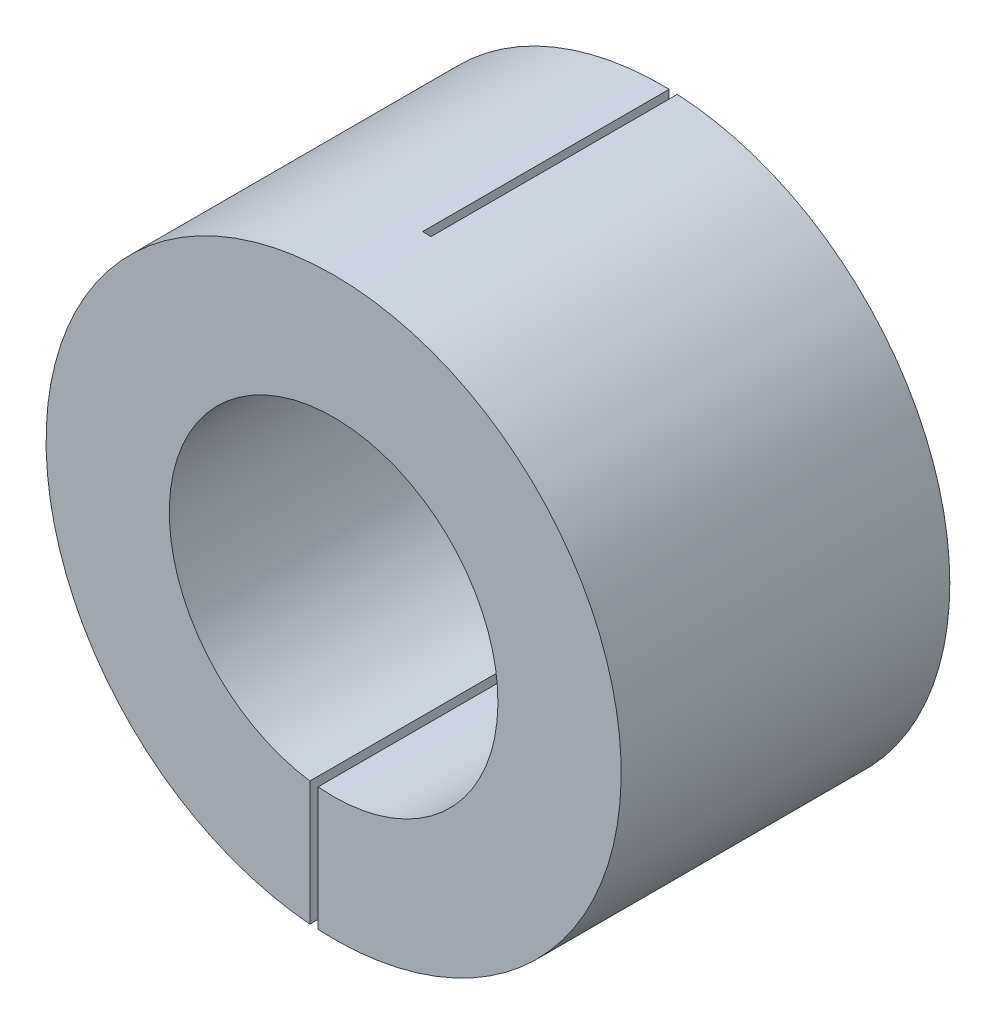
ISO-10303-21;
HEADER;
FILE_DESCRIPTION(('STEP AP214'),'2;1');
FILE_NAME('part.step','',(''),(''),'','','');
FILE_SCHEMA(('AUTOMOTIVE_DESIGN { 1 0 10303 214 1 1 1 1 }'));
ENDSEC;
DATA;
#1=APPLICATION_CONTEXT('core data for automotive mechanical design processes');
#2=APPLICATION_PROTOCOL_DEFINITION('international standard','automotive_design',2000,#1);
#3=PRODUCT_CONTEXT('',#1,'mechanical');
#4=PRODUCT('Part','Part','',(#3));
#5=PRODUCT_RELATED_PRODUCT_CATEGORY('part','',(#4));
#6=PRODUCT_DEFINITION_FORMATION('','',#4);
#7=PRODUCT_DEFINITION_CONTEXT('part definition',#1,'design');
#8=PRODUCT_DEFINITION('design','',#6,#7);
#9=PRODUCT_DEFINITION_SHAPE('','',#8);
#10=(LENGTH_UNIT() NAMED_UNIT(*) SI_UNIT(.MILLI.,.METRE.));
#11=(NAMED_UNIT(*) PLANE_ANGLE_UNIT() SI_UNIT($,.RADIAN.));
#12=(NAMED_UNIT(*) SI_UNIT($,.STERADIAN.) SOLID_ANGLE_UNIT());
#13=UNCERTAINTY_MEASURE_WITH_UNIT(LENGTH_MEASURE(1.E-05),#10,'distance_accuracy_value','');
#14=(GEOMETRIC_REPRESENTATION_CONTEXT(3) GLOBAL_UNCERTAINTY_ASSIGNED_CONTEXT((#13)) GLOBAL_UNIT_ASSIGNED_CONTEXT((#10,
#11,#12)) REPRESENTATION_CONTEXT('',''));
#15=CARTESIAN_POINT('',(0.,0.,0.));
#16=DIRECTION('',(0.,0.,1.));
#17=DIRECTION('',(1.,0.,0.));
#18=AXIS2_PLACEMENT_3D('',#15,#16,#17);
#19=CARTESIAN_POINT('',(0.,0.,20.));
#20=DIRECTION('',(0.,0.,1.));
#21=DIRECTION('',(1.,0.,0.));
#22=AXIS2_PLACEMENT_3D('',#19,#20,#21);
#23=PLANE('',#22);
#24=DIRECTION('',(0.,1.,0.));
#25=VECTOR('',#24,1.);
#26=CARTESIAN_POINT('',(-0.945478964410786,-0.27750304431198,20.));
#27=LINE('',#26,#25);
#28=CARTESIAN_POINT('',(-0.945478964410784,-17.4744404639421,20.));
#29=VERTEX_POINT('',#28);
#30=CARTESIAN_POINT('',(-0.945478964410785,-9.95520313845261,20.));
#31=VERTEX_POINT('',#30);
#32=EDGE_CURVE('E179',#29,#31,#27,.T.);
#33=ORIENTED_EDGE('',*,*,#32,.F.);
#34=CARTESIAN_POINT('',(0.,0.,20.));
#35=DIRECTION('',(0.,0.,1.));
#36=DIRECTION('',(1.,0.,0.));
#37=AXIS2_PLACEMENT_3D('',#34,#35,#36);
#38=CIRCLE('',#37,17.5);
#39=CARTESIAN_POINT('',(-1.44547896441078,-17.4402004163784,20.));
#40=VERTEX_POINT('',#39);
#41=EDGE_CURVE('E139',#29,#40,#38,.T.);
#42=ORIENTED_EDGE('',*,*,#41,.T.);
#43=DIRECTION('',(0.,-1.,0.));
#44=VECTOR('',#43,1.);
#45=CARTESIAN_POINT('',(-1.44547896441079,-0.27750304431198,20.));
#46=LINE('',#45,#44);
#47=CARTESIAN_POINT('',(-1.44547896441078,-9.89497804764851,20.));
#48=VERTEX_POINT('',#47);
#49=EDGE_CURVE('E183',#48,#40,#46,.T.);
#50=ORIENTED_EDGE('',*,*,#49,.F.);
#51=CARTESIAN_POINT('',(0.,0.,20.));
#52=DIRECTION('',(0.,0.,1.));
#53=DIRECTION('',(1.,0.,0.));
#54=AXIS2_PLACEMENT_3D('',#51,#52,#53);
#55=CIRCLE('',#54,10.);
#56=EDGE_CURVE('E128',#31,#48,#55,.T.);
#57=ORIENTED_EDGE('',*,*,#56,.F.);
#58=EDGE_LOOP('',(#33,#42,#50,#57));
#59=FACE_BOUND('',#58,.T.);
#60=ADVANCED_FACE('F39',(#59),#23,.T.);
#61=CARTESIAN_POINT('',(0.,0.,0.));
#62=DIRECTION('',(0.,0.,1.));
#63=DIRECTION('',(1.,0.,0.));
#64=AXIS2_PLACEMENT_3D('',#61,#62,#63);
#65=PLANE('',#64);
#66=CARTESIAN_POINT('',(0.,0.,0.));
#67=DIRECTION('',(0.,0.,1.));
#68=DIRECTION('',(1.,0.,0.));
#69=AXIS2_PLACEMENT_3D('',#66,#67,#68);
#70=CIRCLE('',#69,17.5);
#71=CARTESIAN_POINT('',(0.419659449414419,17.4949674462834,0.));
#72=VERTEX_POINT('',#71);
#73=CARTESIAN_POINT('',(0.919659449414419,17.4758183355488,0.));
#74=VERTEX_POINT('',#73);
#75=EDGE_CURVE('E120',#72,#74,#70,.T.);
#76=ORIENTED_EDGE('',*,*,#75,.F.);
#77=DIRECTION('',(0.,1.,0.));
#78=VECTOR('',#77,1.);
#79=CARTESIAN_POINT('',(0.419659449414419,-2.68637365486835,0.));
#80=LINE('',#79,#78);
#81=CARTESIAN_POINT('',(0.419659449414419,9.99119041688813,0.));
#82=VERTEX_POINT('',#81);
#83=EDGE_CURVE('E106',#82,#72,#80,.T.);
#84=ORIENTED_EDGE('',*,*,#83,.F.);
#85=CARTESIAN_POINT('',(0.,0.,0.));
#86=DIRECTION('',(0.,0.,1.));
#87=DIRECTION('',(1.,0.,0.));
#88=AXIS2_PLACEMENT_3D('',#85,#86,#87);
#89=CIRCLE('',#88,10.);
#90=CARTESIAN_POINT('',(0.919659449414419,9.95762152811116,0.));
#91=VERTEX_POINT('',#90);
#92=EDGE_CURVE('E118',#82,#91,#89,.T.);
#93=ORIENTED_EDGE('',*,*,#92,.T.);
#94=DIRECTION('',(0.,-1.,0.));
#95=VECTOR('',#94,1.);
#96=CARTESIAN_POINT('',(0.919659449414419,-2.68637365486835,0.));
#97=LINE('',#96,#95);
#98=EDGE_CURVE('E122',#74,#91,#97,.T.);
#99=ORIENTED_EDGE('',*,*,#98,.F.);
#100=EDGE_LOOP('',(#76,#84,#93,#99));
#101=FACE_BOUND('',#100,.T.);
#102=ADVANCED_FACE('F116',(#101),#65,.F.);
#103=CARTESIAN_POINT('',(0.,0.,20.));
#104=DIRECTION('',(0.,0.,-1.));
#105=DIRECTION('',(-1.,0.,0.));
#106=AXIS2_PLACEMENT_3D('',#103,#104,#105);
#107=CYLINDRICAL_SURFACE('',#106,17.5);
#108=ORIENTED_EDGE('',*,*,#41,.F.);
#109=DIRECTION('',(0.,0.,-1.));
#110=VECTOR('',#109,1.);
#111=CARTESIAN_POINT('',(-0.945478964410784,-17.4744404639421,20.));
#112=LINE('',#111,#110);
#113=CARTESIAN_POINT('',(-0.945478964410784,-17.4744404639421,5.));
#114=VERTEX_POINT('',#113);
#115=EDGE_CURVE('E129',#29,#114,#112,.T.);
#116=ORIENTED_EDGE('',*,*,#115,.T.);
#117=CARTESIAN_POINT('',(0.,0.,5.));
#118=DIRECTION('',(0.,0.,1.));
#119=DIRECTION('',(1.,0.,0.));
#120=AXIS2_PLACEMENT_3D('',#117,#118,#119);
#121=CIRCLE('',#120,17.5);
#122=CARTESIAN_POINT('',(-1.44547896441078,-17.4402004163784,5.));
#123=VERTEX_POINT('',#122);
#124=EDGE_CURVE('E187',#123,#114,#121,.T.);
#125=ORIENTED_EDGE('',*,*,#124,.F.);
#126=DIRECTION('',(0.,0.,-1.));
#127=VECTOR('',#126,1.);
#128=CARTESIAN_POINT('',(-1.44547896441078,-17.4402004163784,20.));
#129=LINE('',#128,#127);
#130=EDGE_CURVE('E136',#123,#40,#129,.F.);
#131=ORIENTED_EDGE('',*,*,#130,.T.);
#132=EDGE_LOOP('',(#108,#116,#125,#131));
#133=FACE_BOUND('',#132,.T.);
#134=CARTESIAN_POINT('',(0.,0.,15.));
#135=DIRECTION('',(0.,0.,1.));
#136=DIRECTION('',(1.,0.,0.));
#137=AXIS2_PLACEMENT_3D('',#134,#135,#136);
#138=CIRCLE('',#137,17.5);
#139=CARTESIAN_POINT('',(0.919659449414419,17.4758183355488,15.));
#140=VERTEX_POINT('',#139);
#141=CARTESIAN_POINT('',(0.419659449414419,17.4949674462834,15.));
#142=VERTEX_POINT('',#141);
#143=EDGE_CURVE('E163',#140,#142,#138,.T.);
#144=ORIENTED_EDGE('',*,*,#143,.T.);
#145=DIRECTION('',(0.,0.,-1.));
#146=VECTOR('',#145,1.);
#147=CARTESIAN_POINT('',(0.419659449414419,17.4949674462834,20.));
#148=LINE('',#147,#146);
#149=EDGE_CURVE('E167',#142,#72,#148,.T.);
#150=ORIENTED_EDGE('',*,*,#149,.T.);
#151=ORIENTED_EDGE('',*,*,#75,.T.);
#152=DIRECTION('',(0.,0.,-1.));
#153=VECTOR('',#152,1.);
#154=CARTESIAN_POINT('',(0.919659449414419,17.4758183355488,20.));
#155=LINE('',#154,#153);
#156=EDGE_CURVE('E168',#74,#140,#155,.F.);
#157=ORIENTED_EDGE('',*,*,#156,.T.);
#158=EDGE_LOOP('',(#144,#150,#151,#157));
#159=FACE_BOUND('',#158,.T.);
#160=ADVANCED_FACE('F41',(#133,#159),#107,.T.);
#161=CARTESIAN_POINT('',(0.,0.,20.));
#162=DIRECTION('',(0.,0.,-1.));
#163=DIRECTION('',(-1.,0.,0.));
#164=AXIS2_PLACEMENT_3D('',#161,#162,#163);
#165=CYLINDRICAL_SURFACE('',#164,10.);
#166=DIRECTION('',(0.,0.,-1.));
#167=VECTOR('',#166,1.);
#168=CARTESIAN_POINT('',(0.419659449414419,9.99119041688813,20.));
#169=LINE('',#168,#167);
#170=CARTESIAN_POINT('',(0.419659449414419,9.99119041688813,15.));
#171=VERTEX_POINT('',#170);
#172=EDGE_CURVE('E11',#171,#82,#169,.T.);
#173=ORIENTED_EDGE('',*,*,#172,.F.);
#174=CARTESIAN_POINT('',(0.,0.,15.));
#175=DIRECTION('',(0.,0.,1.));
#176=DIRECTION('',(1.,0.,0.));
#177=AXIS2_PLACEMENT_3D('',#174,#175,#176);
#178=CIRCLE('',#177,10.);
#179=CARTESIAN_POINT('',(0.919659449414419,9.95762152811116,15.));
#180=VERTEX_POINT('',#179);
#181=EDGE_CURVE('E155',#180,#171,#178,.T.);
#182=ORIENTED_EDGE('',*,*,#181,.F.);
#183=DIRECTION('',(0.,0.,-1.));
#184=VECTOR('',#183,1.);
#185=CARTESIAN_POINT('',(0.919659449414419,9.95762152811116,20.));
#186=LINE('',#185,#184);
#187=EDGE_CURVE('E48',#91,#180,#186,.F.);
#188=ORIENTED_EDGE('',*,*,#187,.F.);
#189=ORIENTED_EDGE('',*,*,#92,.F.);
#190=EDGE_LOOP('',(#173,#182,#188,#189));
#191=FACE_BOUND('',#190,.T.);
#192=DIRECTION('',(0.,0.,-1.));
#193=VECTOR('',#192,1.);
#194=CARTESIAN_POINT('',(-0.945478964410785,-9.95520313845261,20.));
#195=LINE('',#194,#193);
#196=CARTESIAN_POINT('',(-0.945478964410785,-9.95520313845261,5.));
#197=VERTEX_POINT('',#196);
#198=EDGE_CURVE('E152',#31,#197,#195,.T.);
#199=ORIENTED_EDGE('',*,*,#198,.F.);
#200=ORIENTED_EDGE('',*,*,#56,.T.);
#201=DIRECTION('',(0.,0.,-1.));
#202=VECTOR('',#201,1.);
#203=CARTESIAN_POINT('',(-1.44547896441078,-9.89497804764851,20.));
#204=LINE('',#203,#202);
#205=CARTESIAN_POINT('',(-1.44547896441078,-9.89497804764851,5.));
#206=VERTEX_POINT('',#205);
#207=EDGE_CURVE('E149',#206,#48,#204,.F.);
#208=ORIENTED_EDGE('',*,*,#207,.F.);
#209=CARTESIAN_POINT('',(0.,0.,5.));
#210=DIRECTION('',(0.,0.,1.));
#211=DIRECTION('',(1.,0.,0.));
#212=AXIS2_PLACEMENT_3D('',#209,#210,#211);
#213=CIRCLE('',#212,10.);
#214=EDGE_CURVE('E143',#206,#197,#213,.T.);
#215=ORIENTED_EDGE('',*,*,#214,.T.);
#216=EDGE_LOOP('',(#199,#200,#208,#215));
#217=FACE_BOUND('',#216,.T.);
#218=ADVANCED_FACE('F125',(#191,#217),#165,.F.);
#219=CARTESIAN_POINT('',(-0.945478964410786,-0.27750304431198,5.));
#220=DIRECTION('',(1.,0.,0.));
#221=DIRECTION('',(0.,1.,0.));
#222=AXIS2_PLACEMENT_3D('',#219,#220,#221);
#223=PLANE('',#222);
#224=ORIENTED_EDGE('',*,*,#32,.T.);
#225=ORIENTED_EDGE('',*,*,#198,.T.);
#226=DIRECTION('',(0.,1.,0.));
#227=VECTOR('',#226,1.);
#228=CARTESIAN_POINT('',(-0.945478964410786,-0.27750304431198,5.));
#229=LINE('',#228,#227);
#230=EDGE_CURVE('E63',#114,#197,#229,.T.);
#231=ORIENTED_EDGE('',*,*,#230,.F.);
#232=ORIENTED_EDGE('',*,*,#115,.F.);
#233=EDGE_LOOP('',(#224,#225,#231,#232));
#234=FACE_BOUND('',#233,.T.);
#235=ADVANCED_FACE('F207',(#234),#223,.F.);
#236=CARTESIAN_POINT('',(-1.44547896441079,-0.27750304431198,5.));
#237=DIRECTION('',(-1.,0.,0.));
#238=DIRECTION('',(0.,-1.,0.));
#239=AXIS2_PLACEMENT_3D('',#236,#237,#238);
#240=PLANE('',#239);
#241=DIRECTION('',(0.,-1.,0.));
#242=VECTOR('',#241,1.);
#243=CARTESIAN_POINT('',(-1.44547896441079,-0.27750304431198,5.));
#244=LINE('',#243,#242);
#245=EDGE_CURVE('E182',#206,#123,#244,.T.);
#246=ORIENTED_EDGE('',*,*,#245,.F.);
#247=ORIENTED_EDGE('',*,*,#207,.T.);
#248=ORIENTED_EDGE('',*,*,#49,.T.);
#249=ORIENTED_EDGE('',*,*,#130,.F.);
#250=EDGE_LOOP('',(#246,#247,#248,#249));
#251=FACE_BOUND('',#250,.T.);
#252=ADVANCED_FACE('F210',(#251),#240,.F.);
#253=CARTESIAN_POINT('',(0.,0.,5.));
#254=DIRECTION('',(0.,0.,1.));
#255=DIRECTION('',(1.,0.,0.));
#256=AXIS2_PLACEMENT_3D('',#253,#254,#255);
#257=PLANE('',#256);
#258=ORIENTED_EDGE('',*,*,#124,.T.);
#259=ORIENTED_EDGE('',*,*,#230,.T.);
#260=ORIENTED_EDGE('',*,*,#214,.F.);
#261=ORIENTED_EDGE('',*,*,#245,.T.);
#262=EDGE_LOOP('',(#258,#259,#260,#261));
#263=FACE_BOUND('',#262,.T.);
#264=ADVANCED_FACE('F209',(#263),#257,.T.);
#265=CARTESIAN_POINT('',(0.419659449414419,-2.68637365486835,15.));
#266=DIRECTION('',(-1.,0.,0.));
#267=DIRECTION('',(0.,0.,1.));
#268=AXIS2_PLACEMENT_3D('',#265,#266,#267);
#269=PLANE('',#268);
#270=DIRECTION('',(0.,1.,0.));
#271=VECTOR('',#270,1.);
#272=CARTESIAN_POINT('',(0.419659449414419,-2.68637365486835,15.));
#273=LINE('',#272,#271);
#274=EDGE_CURVE('E109',#171,#142,#273,.T.);
#275=ORIENTED_EDGE('',*,*,#274,.F.);
#276=ORIENTED_EDGE('',*,*,#172,.T.);
#277=ORIENTED_EDGE('',*,*,#83,.T.);
#278=ORIENTED_EDGE('',*,*,#149,.F.);
#279=EDGE_LOOP('',(#275,#276,#277,#278));
#280=FACE_BOUND('',#279,.T.);
#281=ADVANCED_FACE('F105',(#280),#269,.F.);
#282=CARTESIAN_POINT('',(0.919659449414419,-2.68637365486835,15.));
#283=DIRECTION('',(1.,0.,0.));
#284=DIRECTION('',(0.,0.,-1.));
#285=AXIS2_PLACEMENT_3D('',#282,#283,#284);
#286=PLANE('',#285);
#287=ORIENTED_EDGE('',*,*,#98,.T.);
#288=ORIENTED_EDGE('',*,*,#187,.T.);
#289=DIRECTION('',(0.,-1.,0.));
#290=VECTOR('',#289,1.);
#291=CARTESIAN_POINT('',(0.919659449414419,-2.68637365486835,15.));
#292=LINE('',#291,#290);
#293=EDGE_CURVE('E55',#140,#180,#292,.T.);
#294=ORIENTED_EDGE('',*,*,#293,.F.);
#295=ORIENTED_EDGE('',*,*,#156,.F.);
#296=EDGE_LOOP('',(#287,#288,#294,#295));
#297=FACE_BOUND('',#296,.T.);
#298=ADVANCED_FACE('F159',(#297),#286,.F.);
#299=CARTESIAN_POINT('',(0.,0.,15.));
#300=DIRECTION('',(0.,0.,1.));
#301=DIRECTION('',(1.,0.,0.));
#302=AXIS2_PLACEMENT_3D('',#299,#300,#301);
#303=PLANE('',#302);
#304=ORIENTED_EDGE('',*,*,#293,.T.);
#305=ORIENTED_EDGE('',*,*,#181,.T.);
#306=ORIENTED_EDGE('',*,*,#274,.T.);
#307=ORIENTED_EDGE('',*,*,#143,.F.);
#308=EDGE_LOOP('',(#304,#305,#306,#307));
#309=FACE_BOUND('',#308,.T.);
#310=ADVANCED_FACE('F161',(#309),#303,.F.);
#311=CLOSED_SHELL('',(#60,#102,#160,#218,#235,#252,#264,#281,#298,#310));
#312=MANIFOLD_SOLID_BREP('B2',#311);
#313=ADVANCED_BREP_SHAPE_REPRESENTATION('',(#18,#312),#14);
#314=SHAPE_DEFINITION_REPRESENTATION(#9,#313);
ENDSEC;
END-ISO-10303-21;
